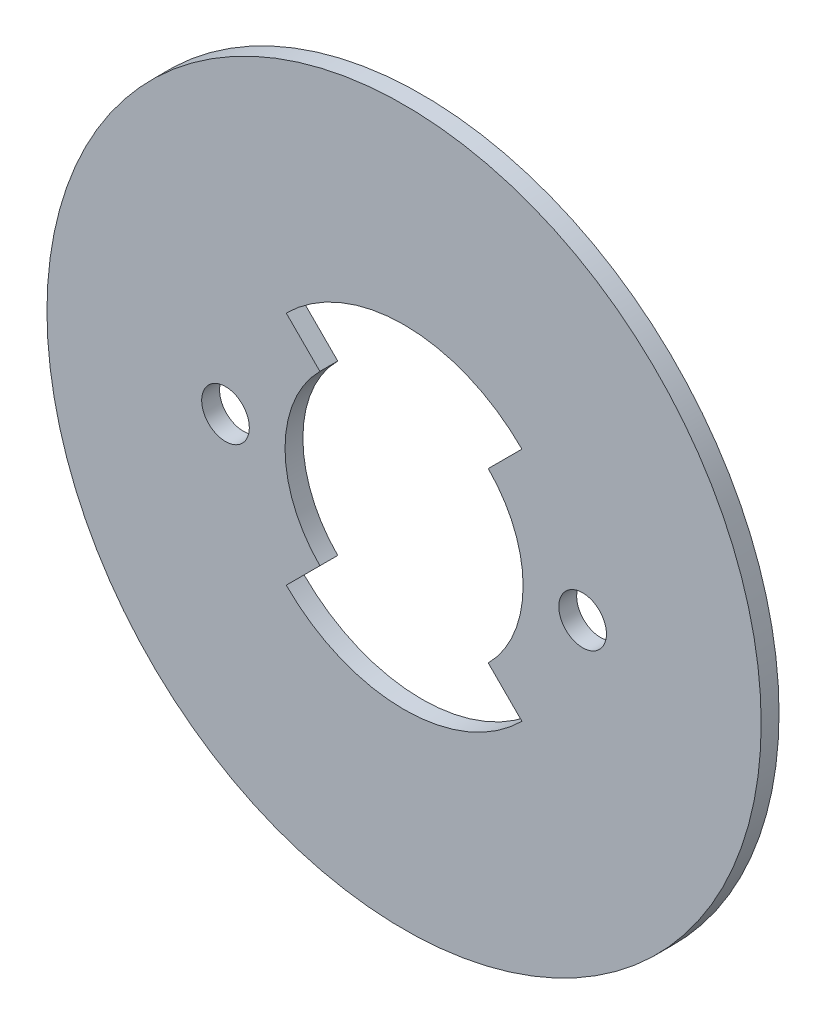
ISO-10303-21;
HEADER;
FILE_DESCRIPTION(('STEP AP214'),'2;1');
FILE_NAME('part.step','',(''),(''),'','','');
FILE_SCHEMA(('AUTOMOTIVE_DESIGN { 1 0 10303 214 1 1 1 1 }'));
ENDSEC;
DATA;
#1=APPLICATION_CONTEXT('core data for automotive mechanical design processes');
#2=APPLICATION_PROTOCOL_DEFINITION('international standard','automotive_design',2000,#1);
#3=PRODUCT_CONTEXT('',#1,'mechanical');
#4=PRODUCT('Part','Part','',(#3));
#5=PRODUCT_RELATED_PRODUCT_CATEGORY('part','',(#4));
#6=PRODUCT_DEFINITION_FORMATION('','',#4);
#7=PRODUCT_DEFINITION_CONTEXT('part definition',#1,'design');
#8=PRODUCT_DEFINITION('design','',#6,#7);
#9=PRODUCT_DEFINITION_SHAPE('','',#8);
#10=(LENGTH_UNIT() NAMED_UNIT(*) SI_UNIT(.MILLI.,.METRE.));
#11=(NAMED_UNIT(*) PLANE_ANGLE_UNIT() SI_UNIT($,.RADIAN.));
#12=(NAMED_UNIT(*) SI_UNIT($,.STERADIAN.) SOLID_ANGLE_UNIT());
#13=UNCERTAINTY_MEASURE_WITH_UNIT(LENGTH_MEASURE(1.E-05),#10,'distance_accuracy_value','');
#14=(GEOMETRIC_REPRESENTATION_CONTEXT(3) GLOBAL_UNCERTAINTY_ASSIGNED_CONTEXT((#13)) GLOBAL_UNIT_ASSIGNED_CONTEXT((#10,
#11,#12)) REPRESENTATION_CONTEXT('',''));
#15=CARTESIAN_POINT('',(0.,0.,0.));
#16=DIRECTION('',(0.,0.,1.));
#17=DIRECTION('',(1.,0.,0.));
#18=AXIS2_PLACEMENT_3D('',#15,#16,#17);
#19=CARTESIAN_POINT('',(0.,0.,1.5));
#20=DIRECTION('',(0.,0.,1.));
#21=DIRECTION('',(1.,0.,0.));
#22=AXIS2_PLACEMENT_3D('',#19,#20,#21);
#23=PLANE('',#22);
#24=CARTESIAN_POINT('',(0.,0.,1.5));
#25=DIRECTION('',(0.,0.,1.));
#26=DIRECTION('',(1.,0.,0.));
#27=AXIS2_PLACEMENT_3D('',#24,#25,#26);
#28=CIRCLE('',#27,10.);
#29=CARTESIAN_POINT('',(7.07106781186544,-7.07106781186551,1.5));
#30=VERTEX_POINT('',#29);
#31=CARTESIAN_POINT('',(7.07106781186544,7.07106781186551,1.5));
#32=VERTEX_POINT('',#31);
#33=EDGE_CURVE('E176',#30,#32,#28,.T.);
#34=ORIENTED_EDGE('',*,*,#33,.F.);
#35=DIRECTION('',(-0.707106781186544,0.707106781186551,0.));
#36=VECTOR('',#35,1.);
#37=CARTESIAN_POINT('',(0.,0.,1.5));
#38=LINE('',#37,#36);
#39=CARTESIAN_POINT('',(9.89949493661161,-9.89949493661171,1.5));
#40=VERTEX_POINT('',#39);
#41=EDGE_CURVE('E151',#40,#30,#38,.T.);
#42=ORIENTED_EDGE('',*,*,#41,.F.);
#43=CARTESIAN_POINT('',(0.,0.,1.5));
#44=DIRECTION('',(0.,0.,1.));
#45=DIRECTION('',(1.,0.,0.));
#46=AXIS2_PLACEMENT_3D('',#43,#44,#45);
#47=CIRCLE('',#46,14.);
#48=CARTESIAN_POINT('',(-9.89949493661161,-9.89949493661171,1.5));
#49=VERTEX_POINT('',#48);
#50=EDGE_CURVE('E118',#49,#40,#47,.T.);
#51=ORIENTED_EDGE('',*,*,#50,.F.);
#52=DIRECTION('',(0.707106781186544,0.707106781186551,0.));
#53=VECTOR('',#52,1.);
#54=CARTESIAN_POINT('',(0.,0.,1.5));
#55=LINE('',#54,#53);
#56=CARTESIAN_POINT('',(-7.07106781186544,-7.07106781186551,1.5));
#57=VERTEX_POINT('',#56);
#58=EDGE_CURVE('E164',#49,#57,#55,.T.);
#59=ORIENTED_EDGE('',*,*,#58,.T.);
#60=CARTESIAN_POINT('',(0.,0.,1.5));
#61=DIRECTION('',(0.,0.,1.));
#62=DIRECTION('',(1.,0.,0.));
#63=AXIS2_PLACEMENT_3D('',#60,#61,#62);
#64=CIRCLE('',#63,10.);
#65=CARTESIAN_POINT('',(-7.07106781186543,7.07106781186552,1.5));
#66=VERTEX_POINT('',#65);
#67=EDGE_CURVE('E167',#66,#57,#64,.T.);
#68=ORIENTED_EDGE('',*,*,#67,.F.);
#69=DIRECTION('',(-0.707106781186544,0.707106781186551,0.));
#70=VECTOR('',#69,1.);
#71=CARTESIAN_POINT('',(0.,0.,1.5));
#72=LINE('',#71,#70);
#73=CARTESIAN_POINT('',(-9.8994949366116,9.89949493661172,1.5));
#74=VERTEX_POINT('',#73);
#75=EDGE_CURVE('E169',#66,#74,#72,.T.);
#76=ORIENTED_EDGE('',*,*,#75,.T.);
#77=CARTESIAN_POINT('',(0.,0.,1.5));
#78=DIRECTION('',(0.,0.,1.));
#79=DIRECTION('',(1.,0.,0.));
#80=AXIS2_PLACEMENT_3D('',#77,#78,#79);
#81=CIRCLE('',#80,14.);
#82=CARTESIAN_POINT('',(9.89949493661161,9.89949493661172,1.5));
#83=VERTEX_POINT('',#82);
#84=EDGE_CURVE('E172',#83,#74,#81,.T.);
#85=ORIENTED_EDGE('',*,*,#84,.F.);
#86=DIRECTION('',(0.707106781186544,0.707106781186551,0.));
#87=VECTOR('',#86,1.);
#88=CARTESIAN_POINT('',(0.,0.,1.5));
#89=LINE('',#88,#87);
#90=EDGE_CURVE('E174',#32,#83,#89,.T.);
#91=ORIENTED_EDGE('',*,*,#90,.F.);
#92=EDGE_LOOP('',(#34,#42,#51,#59,#68,#76,#85,#91));
#93=FACE_BOUND('',#92,.T.);
#94=CARTESIAN_POINT('',(-15.,0.,1.5));
#95=DIRECTION('',(0.,0.,1.));
#96=DIRECTION('',(1.,0.,0.));
#97=AXIS2_PLACEMENT_3D('',#94,#95,#96);
#98=CIRCLE('',#97,2.);
#99=CARTESIAN_POINT('',(-13.,0.,1.5));
#100=VERTEX_POINT('',#99);
#101=EDGE_CURVE('E185',#100,#100,#98,.T.);
#102=ORIENTED_EDGE('',*,*,#101,.F.);
#103=EDGE_LOOP('',(#102));
#104=FACE_BOUND('',#103,.T.);
#105=CARTESIAN_POINT('',(0.,0.,1.5));
#106=DIRECTION('',(0.,0.,1.));
#107=DIRECTION('',(1.,0.,0.));
#108=AXIS2_PLACEMENT_3D('',#105,#106,#107);
#109=CIRCLE('',#108,30.);
#110=CARTESIAN_POINT('',(30.,0.,1.5));
#111=VERTEX_POINT('',#110);
#112=EDGE_CURVE('E13',#111,#111,#109,.T.);
#113=ORIENTED_EDGE('',*,*,#112,.T.);
#114=EDGE_LOOP('',(#113));
#115=FACE_BOUND('',#114,.T.);
#116=CARTESIAN_POINT('',(15.,0.,1.5));
#117=DIRECTION('',(0.,0.,1.));
#118=DIRECTION('',(1.,0.,0.));
#119=AXIS2_PLACEMENT_3D('',#116,#117,#118);
#120=CIRCLE('',#119,2.);
#121=CARTESIAN_POINT('',(17.,0.,1.5));
#122=VERTEX_POINT('',#121);
#123=EDGE_CURVE('E179',#122,#122,#120,.T.);
#124=ORIENTED_EDGE('',*,*,#123,.F.);
#125=EDGE_LOOP('',(#124));
#126=FACE_BOUND('',#125,.T.);
#127=ADVANCED_FACE('F47',(#93,#104,#115,#126),#23,.T.);
#128=CARTESIAN_POINT('',(0.,0.,0.));
#129=DIRECTION('',(0.,0.,1.));
#130=DIRECTION('',(1.,0.,0.));
#131=AXIS2_PLACEMENT_3D('',#128,#129,#130);
#132=PLANE('',#131);
#133=DIRECTION('',(0.707106781186544,-0.707106781186551,0.));
#134=VECTOR('',#133,1.);
#135=CARTESIAN_POINT('',(0.,0.,0.));
#136=LINE('',#135,#134);
#137=CARTESIAN_POINT('',(7.07106781186544,-7.07106781186551,0.));
#138=VERTEX_POINT('',#137);
#139=CARTESIAN_POINT('',(9.89949493661161,-9.89949493661171,0.));
#140=VERTEX_POINT('',#139);
#141=EDGE_CURVE('E124',#138,#140,#136,.T.);
#142=ORIENTED_EDGE('',*,*,#141,.F.);
#143=CARTESIAN_POINT('',(0.,0.,0.));
#144=DIRECTION('',(0.,0.,-1.));
#145=DIRECTION('',(-1.,0.,0.));
#146=AXIS2_PLACEMENT_3D('',#143,#144,#145);
#147=CIRCLE('',#146,10.);
#148=CARTESIAN_POINT('',(7.07106781186544,7.07106781186551,0.));
#149=VERTEX_POINT('',#148);
#150=EDGE_CURVE('E70',#149,#138,#147,.T.);
#151=ORIENTED_EDGE('',*,*,#150,.F.);
#152=DIRECTION('',(-0.707106781186544,-0.707106781186551,0.));
#153=VECTOR('',#152,1.);
#154=CARTESIAN_POINT('',(0.,0.,0.));
#155=LINE('',#154,#153);
#156=CARTESIAN_POINT('',(9.89949493661161,9.89949493661172,0.));
#157=VERTEX_POINT('',#156);
#158=EDGE_CURVE('E146',#157,#149,#155,.T.);
#159=ORIENTED_EDGE('',*,*,#158,.F.);
#160=CARTESIAN_POINT('',(0.,0.,0.));
#161=DIRECTION('',(0.,0.,-1.));
#162=DIRECTION('',(-1.,0.,0.));
#163=AXIS2_PLACEMENT_3D('',#160,#161,#162);
#164=CIRCLE('',#163,14.);
#165=CARTESIAN_POINT('',(-9.8994949366116,9.89949493661172,0.));
#166=VERTEX_POINT('',#165);
#167=EDGE_CURVE('E143',#166,#157,#164,.T.);
#168=ORIENTED_EDGE('',*,*,#167,.F.);
#169=DIRECTION('',(0.707106781186544,-0.707106781186551,0.));
#170=VECTOR('',#169,1.);
#171=CARTESIAN_POINT('',(0.,0.,0.));
#172=LINE('',#171,#170);
#173=CARTESIAN_POINT('',(-7.07106781186543,7.07106781186552,0.));
#174=VERTEX_POINT('',#173);
#175=EDGE_CURVE('E140',#166,#174,#172,.T.);
#176=ORIENTED_EDGE('',*,*,#175,.T.);
#177=CARTESIAN_POINT('',(0.,0.,0.));
#178=DIRECTION('',(0.,0.,-1.));
#179=DIRECTION('',(-1.,0.,0.));
#180=AXIS2_PLACEMENT_3D('',#177,#178,#179);
#181=CIRCLE('',#180,10.);
#182=CARTESIAN_POINT('',(-7.07106781186544,-7.07106781186551,0.));
#183=VERTEX_POINT('',#182);
#184=EDGE_CURVE('E134',#183,#174,#181,.T.);
#185=ORIENTED_EDGE('',*,*,#184,.F.);
#186=DIRECTION('',(-0.707106781186544,-0.707106781186551,0.));
#187=VECTOR('',#186,1.);
#188=CARTESIAN_POINT('',(0.,0.,0.));
#189=LINE('',#188,#187);
#190=CARTESIAN_POINT('',(-9.89949493661161,-9.89949493661171,0.));
#191=VERTEX_POINT('',#190);
#192=EDGE_CURVE('E132',#183,#191,#189,.T.);
#193=ORIENTED_EDGE('',*,*,#192,.T.);
#194=CARTESIAN_POINT('',(0.,0.,0.));
#195=DIRECTION('',(0.,0.,-1.));
#196=DIRECTION('',(-1.,0.,0.));
#197=AXIS2_PLACEMENT_3D('',#194,#195,#196);
#198=CIRCLE('',#197,14.);
#199=EDGE_CURVE('E115',#140,#191,#198,.T.);
#200=ORIENTED_EDGE('',*,*,#199,.F.);
#201=EDGE_LOOP('',(#142,#151,#159,#168,#176,#185,#193,#200));
#202=FACE_BOUND('',#201,.T.);
#203=CARTESIAN_POINT('',(0.,0.,0.));
#204=DIRECTION('',(0.,0.,1.));
#205=DIRECTION('',(1.,0.,0.));
#206=AXIS2_PLACEMENT_3D('',#203,#204,#205);
#207=CIRCLE('',#206,30.);
#208=CARTESIAN_POINT('',(30.,0.,0.));
#209=VERTEX_POINT('',#208);
#210=EDGE_CURVE('E51',#209,#209,#207,.T.);
#211=ORIENTED_EDGE('',*,*,#210,.F.);
#212=EDGE_LOOP('',(#211));
#213=FACE_BOUND('',#212,.T.);
#214=CARTESIAN_POINT('',(-15.,0.,0.));
#215=DIRECTION('',(0.,0.,1.));
#216=DIRECTION('',(1.,0.,0.));
#217=AXIS2_PLACEMENT_3D('',#214,#215,#216);
#218=CIRCLE('',#217,2.);
#219=CARTESIAN_POINT('',(-13.,0.,0.));
#220=VERTEX_POINT('',#219);
#221=EDGE_CURVE('E182',#220,#220,#218,.T.);
#222=ORIENTED_EDGE('',*,*,#221,.T.);
#223=EDGE_LOOP('',(#222));
#224=FACE_BOUND('',#223,.T.);
#225=CARTESIAN_POINT('',(15.,0.,0.));
#226=DIRECTION('',(0.,0.,1.));
#227=DIRECTION('',(1.,0.,0.));
#228=AXIS2_PLACEMENT_3D('',#225,#226,#227);
#229=CIRCLE('',#228,2.);
#230=CARTESIAN_POINT('',(17.,0.,0.));
#231=VERTEX_POINT('',#230);
#232=EDGE_CURVE('E178',#231,#231,#229,.T.);
#233=ORIENTED_EDGE('',*,*,#232,.T.);
#234=EDGE_LOOP('',(#233));
#235=FACE_BOUND('',#234,.T.);
#236=ADVANCED_FACE('F128',(#202,#213,#224,#235),#132,.F.);
#237=CARTESIAN_POINT('',(0.,0.,1.5));
#238=DIRECTION('',(0.,0.,-1.));
#239=DIRECTION('',(-1.,0.,0.));
#240=AXIS2_PLACEMENT_3D('',#237,#238,#239);
#241=CYLINDRICAL_SURFACE('',#240,30.);
#242=ORIENTED_EDGE('',*,*,#112,.F.);
#243=EDGE_LOOP('',(#242));
#244=FACE_BOUND('',#243,.T.);
#245=ORIENTED_EDGE('',*,*,#210,.T.);
#246=EDGE_LOOP('',(#245));
#247=FACE_BOUND('',#246,.T.);
#248=ADVANCED_FACE('F49',(#244,#247),#241,.T.);
#249=CARTESIAN_POINT('',(-15.,0.,1.5));
#250=DIRECTION('',(0.,0.,-1.));
#251=DIRECTION('',(-1.,0.,0.));
#252=AXIS2_PLACEMENT_3D('',#249,#250,#251);
#253=CYLINDRICAL_SURFACE('',#252,2.);
#254=ORIENTED_EDGE('',*,*,#101,.T.);
#255=EDGE_LOOP('',(#254));
#256=FACE_BOUND('',#255,.T.);
#257=ORIENTED_EDGE('',*,*,#221,.F.);
#258=EDGE_LOOP('',(#257));
#259=FACE_BOUND('',#258,.T.);
#260=ADVANCED_FACE('F193',(#256,#259),#253,.F.);
#261=CARTESIAN_POINT('',(15.,0.,1.5));
#262=DIRECTION('',(0.,0.,-1.));
#263=DIRECTION('',(-1.,0.,0.));
#264=AXIS2_PLACEMENT_3D('',#261,#262,#263);
#265=CYLINDRICAL_SURFACE('',#264,2.);
#266=ORIENTED_EDGE('',*,*,#123,.T.);
#267=EDGE_LOOP('',(#266));
#268=FACE_BOUND('',#267,.T.);
#269=ORIENTED_EDGE('',*,*,#232,.F.);
#270=EDGE_LOOP('',(#269));
#271=FACE_BOUND('',#270,.T.);
#272=ADVANCED_FACE('F195',(#268,#271),#265,.F.);
#273=CARTESIAN_POINT('',(0.,0.,10.));
#274=DIRECTION('',(0.,0.,-1.));
#275=DIRECTION('',(-1.,0.,0.));
#276=AXIS2_PLACEMENT_3D('',#273,#274,#275);
#277=CYLINDRICAL_SURFACE('',#276,10.);
#278=ORIENTED_EDGE('',*,*,#33,.T.);
#279=DIRECTION('',(0.,0.,-1.));
#280=VECTOR('',#279,1.);
#281=CARTESIAN_POINT('',(7.07106781186544,7.07106781186551,10.));
#282=LINE('',#281,#280);
#283=EDGE_CURVE('E149',#32,#149,#282,.T.);
#284=ORIENTED_EDGE('',*,*,#283,.T.);
#285=ORIENTED_EDGE('',*,*,#150,.T.);
#286=DIRECTION('',(0.,0.,-1.));
#287=VECTOR('',#286,1.);
#288=CARTESIAN_POINT('',(7.07106781186544,-7.07106781186551,10.));
#289=LINE('',#288,#287);
#290=EDGE_CURVE('E121',#30,#138,#289,.T.);
#291=ORIENTED_EDGE('',*,*,#290,.F.);
#292=EDGE_LOOP('',(#278,#284,#285,#291));
#293=FACE_BOUND('',#292,.T.);
#294=ADVANCED_FACE('F202',(#293),#277,.F.);
#295=CARTESIAN_POINT('',(0.,0.,10.));
#296=DIRECTION('',(0.707106781186551,-0.707106781186544,0.));
#297=DIRECTION('',(0.707106781186544,0.707106781186551,0.));
#298=AXIS2_PLACEMENT_3D('',#295,#296,#297);
#299=PLANE('',#298);
#300=ORIENTED_EDGE('',*,*,#90,.T.);
#301=DIRECTION('',(0.,0.,-1.));
#302=VECTOR('',#301,1.);
#303=CARTESIAN_POINT('',(9.89949493661161,9.89949493661172,10.));
#304=LINE('',#303,#302);
#305=EDGE_CURVE('E152',#83,#157,#304,.T.);
#306=ORIENTED_EDGE('',*,*,#305,.T.);
#307=ORIENTED_EDGE('',*,*,#158,.T.);
#308=ORIENTED_EDGE('',*,*,#283,.F.);
#309=EDGE_LOOP('',(#300,#306,#307,#308));
#310=FACE_BOUND('',#309,.T.);
#311=ADVANCED_FACE('F229',(#310),#299,.F.);
#312=CARTESIAN_POINT('',(0.,0.,10.));
#313=DIRECTION('',(0.,0.,-1.));
#314=DIRECTION('',(-1.,0.,0.));
#315=AXIS2_PLACEMENT_3D('',#312,#313,#314);
#316=CYLINDRICAL_SURFACE('',#315,14.);
#317=ORIENTED_EDGE('',*,*,#84,.T.);
#318=DIRECTION('',(0.,0.,-1.));
#319=VECTOR('',#318,1.);
#320=CARTESIAN_POINT('',(-9.8994949366116,9.89949493661172,10.));
#321=LINE('',#320,#319);
#322=EDGE_CURVE('E154',#74,#166,#321,.T.);
#323=ORIENTED_EDGE('',*,*,#322,.T.);
#324=ORIENTED_EDGE('',*,*,#167,.T.);
#325=ORIENTED_EDGE('',*,*,#305,.F.);
#326=EDGE_LOOP('',(#317,#323,#324,#325));
#327=FACE_BOUND('',#326,.T.);
#328=ADVANCED_FACE('F235',(#327),#316,.F.);
#329=CARTESIAN_POINT('',(0.,0.,10.));
#330=DIRECTION('',(0.707106781186551,0.707106781186544,0.));
#331=DIRECTION('',(-0.707106781186544,0.707106781186551,0.));
#332=AXIS2_PLACEMENT_3D('',#329,#330,#331);
#333=PLANE('',#332);
#334=DIRECTION('',(0.,0.,-1.));
#335=VECTOR('',#334,1.);
#336=CARTESIAN_POINT('',(-7.07106781186543,7.07106781186552,10.));
#337=LINE('',#336,#335);
#338=EDGE_CURVE('E156',#66,#174,#337,.T.);
#339=ORIENTED_EDGE('',*,*,#338,.T.);
#340=ORIENTED_EDGE('',*,*,#175,.F.);
#341=ORIENTED_EDGE('',*,*,#322,.F.);
#342=ORIENTED_EDGE('',*,*,#75,.F.);
#343=EDGE_LOOP('',(#339,#340,#341,#342));
#344=FACE_BOUND('',#343,.T.);
#345=ADVANCED_FACE('F238',(#344),#333,.T.);
#346=CARTESIAN_POINT('',(0.,0.,10.));
#347=DIRECTION('',(0.,0.,-1.));
#348=DIRECTION('',(-1.,0.,0.));
#349=AXIS2_PLACEMENT_3D('',#346,#347,#348);
#350=CYLINDRICAL_SURFACE('',#349,10.);
#351=ORIENTED_EDGE('',*,*,#67,.T.);
#352=DIRECTION('',(0.,0.,-1.));
#353=VECTOR('',#352,1.);
#354=CARTESIAN_POINT('',(-7.07106781186544,-7.07106781186551,10.));
#355=LINE('',#354,#353);
#356=EDGE_CURVE('E158',#57,#183,#355,.T.);
#357=ORIENTED_EDGE('',*,*,#356,.T.);
#358=ORIENTED_EDGE('',*,*,#184,.T.);
#359=ORIENTED_EDGE('',*,*,#338,.F.);
#360=EDGE_LOOP('',(#351,#357,#358,#359));
#361=FACE_BOUND('',#360,.T.);
#362=ADVANCED_FACE('F242',(#361),#350,.F.);
#363=CARTESIAN_POINT('',(0.,0.,10.));
#364=DIRECTION('',(0.707106781186551,-0.707106781186544,0.));
#365=DIRECTION('',(0.707106781186544,0.707106781186551,0.));
#366=AXIS2_PLACEMENT_3D('',#363,#364,#365);
#367=PLANE('',#366);
#368=DIRECTION('',(0.,0.,-1.));
#369=VECTOR('',#368,1.);
#370=CARTESIAN_POINT('',(-9.89949493661161,-9.89949493661171,10.));
#371=LINE('',#370,#369);
#372=EDGE_CURVE('E120',#49,#191,#371,.T.);
#373=ORIENTED_EDGE('',*,*,#372,.T.);
#374=ORIENTED_EDGE('',*,*,#192,.F.);
#375=ORIENTED_EDGE('',*,*,#356,.F.);
#376=ORIENTED_EDGE('',*,*,#58,.F.);
#377=EDGE_LOOP('',(#373,#374,#375,#376));
#378=FACE_BOUND('',#377,.T.);
#379=ADVANCED_FACE('F245',(#378),#367,.T.);
#380=CARTESIAN_POINT('',(0.,0.,10.));
#381=DIRECTION('',(0.,0.,-1.));
#382=DIRECTION('',(-1.,0.,0.));
#383=AXIS2_PLACEMENT_3D('',#380,#381,#382);
#384=CYLINDRICAL_SURFACE('',#383,14.);
#385=ORIENTED_EDGE('',*,*,#50,.T.);
#386=DIRECTION('',(0.,0.,-1.));
#387=VECTOR('',#386,1.);
#388=CARTESIAN_POINT('',(9.89949493661161,-9.89949493661171,10.));
#389=LINE('',#388,#387);
#390=EDGE_CURVE('E62',#40,#140,#389,.T.);
#391=ORIENTED_EDGE('',*,*,#390,.T.);
#392=ORIENTED_EDGE('',*,*,#199,.T.);
#393=ORIENTED_EDGE('',*,*,#372,.F.);
#394=EDGE_LOOP('',(#385,#391,#392,#393));
#395=FACE_BOUND('',#394,.T.);
#396=ADVANCED_FACE('F112',(#395),#384,.F.);
#397=CARTESIAN_POINT('',(0.,0.,10.));
#398=DIRECTION('',(0.707106781186551,0.707106781186544,0.));
#399=DIRECTION('',(-0.707106781186544,0.707106781186551,0.));
#400=AXIS2_PLACEMENT_3D('',#397,#398,#399);
#401=PLANE('',#400);
#402=ORIENTED_EDGE('',*,*,#41,.T.);
#403=ORIENTED_EDGE('',*,*,#290,.T.);
#404=ORIENTED_EDGE('',*,*,#141,.T.);
#405=ORIENTED_EDGE('',*,*,#390,.F.);
#406=EDGE_LOOP('',(#402,#403,#404,#405));
#407=FACE_BOUND('',#406,.T.);
#408=ADVANCED_FACE('F125',(#407),#401,.F.);
#409=CLOSED_SHELL('',(#127,#236,#248,#260,#272,#294,#311,#328,#345,#362,#379,#396,#408));
#410=MANIFOLD_SOLID_BREP('B2',#409);
#411=ADVANCED_BREP_SHAPE_REPRESENTATION('',(#18,#410),#14);
#412=SHAPE_DEFINITION_REPRESENTATION(#9,#411);
ENDSEC;
END-ISO-10303-21;
